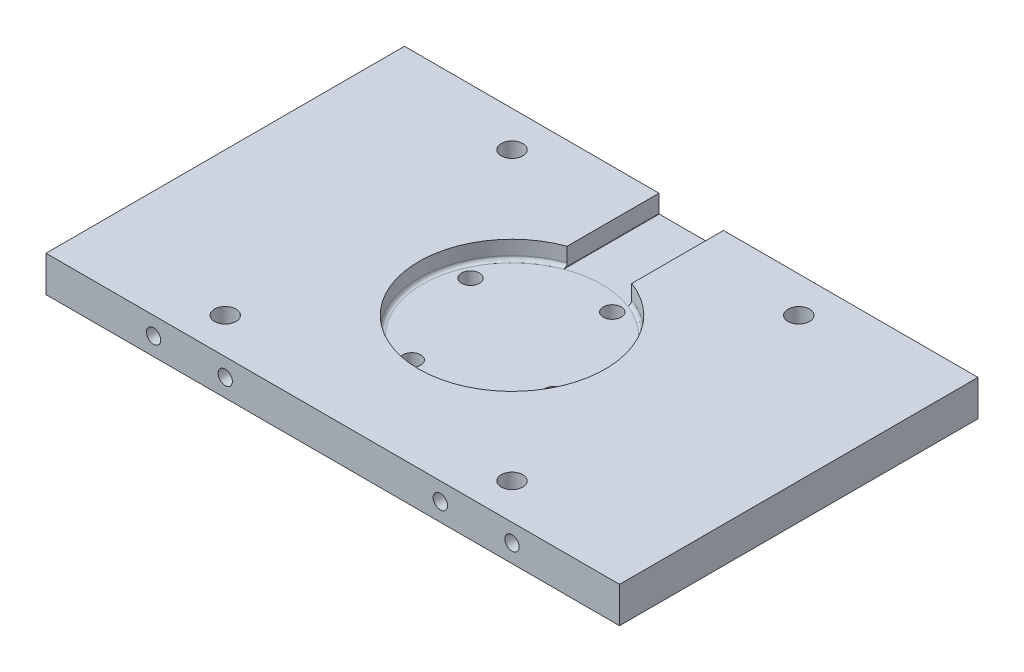
ISO-10303-21;
HEADER;
FILE_DESCRIPTION(('STEP AP214'),'2;1');
FILE_NAME('part.step','',(''),(''),'','','');
FILE_SCHEMA(('AUTOMOTIVE_DESIGN { 1 0 10303 214 1 1 1 1 }'));
ENDSEC;
DATA;
#1=APPLICATION_CONTEXT('core data for automotive mechanical design processes');
#2=APPLICATION_PROTOCOL_DEFINITION('international standard','automotive_design',2000,#1);
#3=PRODUCT_CONTEXT('',#1,'mechanical');
#4=PRODUCT('Part','Part','',(#3));
#5=PRODUCT_RELATED_PRODUCT_CATEGORY('part','',(#4));
#6=PRODUCT_DEFINITION_FORMATION('','',#4);
#7=PRODUCT_DEFINITION_CONTEXT('part definition',#1,'design');
#8=PRODUCT_DEFINITION('design','',#6,#7);
#9=PRODUCT_DEFINITION_SHAPE('','',#8);
#10=(LENGTH_UNIT() NAMED_UNIT(*) SI_UNIT(.MILLI.,.METRE.));
#11=(NAMED_UNIT(*) PLANE_ANGLE_UNIT() SI_UNIT($,.RADIAN.));
#12=(NAMED_UNIT(*) SI_UNIT($,.STERADIAN.) SOLID_ANGLE_UNIT());
#13=UNCERTAINTY_MEASURE_WITH_UNIT(LENGTH_MEASURE(1.E-05),#10,'distance_accuracy_value','');
#14=(GEOMETRIC_REPRESENTATION_CONTEXT(3) GLOBAL_UNCERTAINTY_ASSIGNED_CONTEXT((#13)) GLOBAL_UNIT_ASSIGNED_CONTEXT((#10,
#11,#12)) REPRESENTATION_CONTEXT('',''));
#15=CARTESIAN_POINT('',(0.,0.,0.));
#16=DIRECTION('',(0.,0.,1.));
#17=DIRECTION('',(1.,0.,0.));
#18=AXIS2_PLACEMENT_3D('',#15,#16,#17);
#19=CARTESIAN_POINT('',(80.,10.,-50.));
#20=DIRECTION('',(0.,0.,1.));
#21=DIRECTION('',(1.,0.,0.));
#22=AXIS2_PLACEMENT_3D('',#19,#20,#21);
#23=PLANE('',#22);
#24=CARTESIAN_POINT('',(-30.,5.00000000000001,-50.));
#25=DIRECTION('',(0.,0.,-1.));
#26=DIRECTION('',(-1.,0.,0.));
#27=AXIS2_PLACEMENT_3D('',#24,#25,#26);
#28=CIRCLE('',#27,2.);
#29=CARTESIAN_POINT('',(-31.9999999999999,5.00000000000001,-50.));
#30=VERTEX_POINT('',#29);
#31=EDGE_CURVE('E170',#30,#30,#28,.T.);
#32=ORIENTED_EDGE('',*,*,#31,.F.);
#33=EDGE_LOOP('',(#32));
#34=FACE_BOUND('',#33,.T.);
#35=CARTESIAN_POINT('',(30.,5.00000000000001,-50.));
#36=DIRECTION('',(0.,0.,-1.));
#37=DIRECTION('',(-1.,0.,0.));
#38=AXIS2_PLACEMENT_3D('',#35,#36,#37);
#39=CIRCLE('',#38,2.);
#40=CARTESIAN_POINT('',(28.,5.00000000000001,-50.));
#41=VERTEX_POINT('',#40);
#42=EDGE_CURVE('E185',#41,#41,#39,.T.);
#43=ORIENTED_EDGE('',*,*,#42,.F.);
#44=EDGE_LOOP('',(#43));
#45=FACE_BOUND('',#44,.T.);
#46=CARTESIAN_POINT('',(50.,5.00000000000002,-50.));
#47=DIRECTION('',(0.,0.,-1.));
#48=DIRECTION('',(-1.,0.,0.));
#49=AXIS2_PLACEMENT_3D('',#46,#47,#48);
#50=CIRCLE('',#49,2.);
#51=CARTESIAN_POINT('',(48.,5.00000000000002,-50.));
#52=VERTEX_POINT('',#51);
#53=EDGE_CURVE('E193',#52,#52,#50,.T.);
#54=ORIENTED_EDGE('',*,*,#53,.F.);
#55=EDGE_LOOP('',(#54));
#56=FACE_BOUND('',#55,.T.);
#57=DIRECTION('',(0.,-1.,0.));
#58=VECTOR('',#57,1.);
#59=CARTESIAN_POINT('',(-9.,10.,-50.));
#60=LINE('',#59,#58);
#61=CARTESIAN_POINT('',(-9.,10.,-50.));
#62=VERTEX_POINT('',#61);
#63=CARTESIAN_POINT('',(-9.,5.1,-50.));
#64=VERTEX_POINT('',#63);
#65=EDGE_CURVE('E300',#62,#64,#60,.T.);
#66=ORIENTED_EDGE('',*,*,#65,.T.);
#67=CARTESIAN_POINT('',(-8.9,5.1,-50.));
#68=DIRECTION('',(0.,0.,1.));
#69=DIRECTION('',(1.,0.,0.));
#70=AXIS2_PLACEMENT_3D('',#67,#68,#69);
#71=CIRCLE('',#70,0.1);
#72=CARTESIAN_POINT('',(-8.9,5.,-50.));
#73=VERTEX_POINT('',#72);
#74=EDGE_CURVE('E383',#64,#73,#71,.T.);
#75=ORIENTED_EDGE('',*,*,#74,.T.);
#76=DIRECTION('',(-1.,0.,0.));
#77=VECTOR('',#76,1.);
#78=CARTESIAN_POINT('',(9.,5.,-50.));
#79=LINE('',#78,#77);
#80=CARTESIAN_POINT('',(8.9,5.,-50.));
#81=VERTEX_POINT('',#80);
#82=EDGE_CURVE('E304',#81,#73,#79,.T.);
#83=ORIENTED_EDGE('',*,*,#82,.F.);
#84=CARTESIAN_POINT('',(8.9,5.1,-50.));
#85=DIRECTION('',(0.,0.,1.));
#86=DIRECTION('',(1.,0.,0.));
#87=AXIS2_PLACEMENT_3D('',#84,#85,#86);
#88=CIRCLE('',#87,0.1);
#89=CARTESIAN_POINT('',(9.,5.1,-50.));
#90=VERTEX_POINT('',#89);
#91=EDGE_CURVE('E380',#81,#90,#88,.T.);
#92=ORIENTED_EDGE('',*,*,#91,.T.);
#93=DIRECTION('',(0.,-1.,0.));
#94=VECTOR('',#93,1.);
#95=CARTESIAN_POINT('',(9.,10.,-50.));
#96=LINE('',#95,#94);
#97=CARTESIAN_POINT('',(9.,10.,-50.));
#98=VERTEX_POINT('',#97);
#99=EDGE_CURVE('E308',#98,#90,#96,.T.);
#100=ORIENTED_EDGE('',*,*,#99,.F.);
#101=DIRECTION('',(-1.,0.,0.));
#102=VECTOR('',#101,1.);
#103=CARTESIAN_POINT('',(80.,10.,-50.));
#104=LINE('',#103,#102);
#105=CARTESIAN_POINT('',(80.,10.,-50.));
#106=VERTEX_POINT('',#105);
#107=EDGE_CURVE('E338',#106,#98,#104,.T.);
#108=ORIENTED_EDGE('',*,*,#107,.F.);
#109=DIRECTION('',(0.,-1.,0.));
#110=VECTOR('',#109,1.);
#111=CARTESIAN_POINT('',(80.,10.,-50.));
#112=LINE('',#111,#110);
#113=CARTESIAN_POINT('',(80.,0.,-50.));
#114=VERTEX_POINT('',#113);
#115=EDGE_CURVE('E357',#106,#114,#112,.T.);
#116=ORIENTED_EDGE('',*,*,#115,.T.);
#117=DIRECTION('',(-1.,0.,0.));
#118=VECTOR('',#117,1.);
#119=CARTESIAN_POINT('',(80.,0.,-50.));
#120=LINE('',#119,#118);
#121=CARTESIAN_POINT('',(-80.,0.,-50.));
#122=VERTEX_POINT('',#121);
#123=EDGE_CURVE('E331',#114,#122,#120,.T.);
#124=ORIENTED_EDGE('',*,*,#123,.T.);
#125=DIRECTION('',(0.,-1.,0.));
#126=VECTOR('',#125,1.);
#127=CARTESIAN_POINT('',(-80.,10.,-50.));
#128=LINE('',#127,#126);
#129=CARTESIAN_POINT('',(-80.,10.,-50.));
#130=VERTEX_POINT('',#129);
#131=EDGE_CURVE('E342',#130,#122,#128,.T.);
#132=ORIENTED_EDGE('',*,*,#131,.F.);
#133=EDGE_CURVE('E337',#62,#130,#104,.T.);
#134=ORIENTED_EDGE('',*,*,#133,.F.);
#135=EDGE_LOOP('',(#66,#75,#83,#92,#100,#108,#116,#124,#132,#134));
#136=FACE_BOUND('',#135,.T.);
#137=CARTESIAN_POINT('',(-50.,5.00000000000001,-50.));
#138=DIRECTION('',(0.,0.,-1.));
#139=DIRECTION('',(-1.,0.,0.));
#140=AXIS2_PLACEMENT_3D('',#137,#138,#139);
#141=CIRCLE('',#140,2.);
#142=CARTESIAN_POINT('',(-52.,5.00000000000001,-50.));
#143=VERTEX_POINT('',#142);
#144=EDGE_CURVE('E171',#143,#143,#141,.T.);
#145=ORIENTED_EDGE('',*,*,#144,.F.);
#146=EDGE_LOOP('',(#145));
#147=FACE_BOUND('',#146,.T.);
#148=ADVANCED_FACE('F47',(#34,#45,#56,#136,#147),#23,.F.);
#149=CARTESIAN_POINT('',(0.,5.,0.));
#150=DIRECTION('',(0.,1.,0.));
#151=DIRECTION('',(0.,0.,1.));
#152=AXIS2_PLACEMENT_3D('',#149,#150,#151);
#153=PLANE('',#152);
#154=CARTESIAN_POINT('',(0.,5.,0.));
#155=DIRECTION('',(0.,1.,0.));
#156=DIRECTION('',(0.,0.,1.));
#157=AXIS2_PLACEMENT_3D('',#154,#155,#156);
#158=CIRCLE('',#157,25.);
#159=CARTESIAN_POINT('',(-8.9,5.,-23.3621488737659));
#160=VERTEX_POINT('',#159);
#161=CARTESIAN_POINT('',(8.9,5.,-23.3621488737659));
#162=VERTEX_POINT('',#161);
#163=EDGE_CURVE('E387',#160,#162,#158,.F.);
#164=ORIENTED_EDGE('',*,*,#163,.T.);
#165=DIRECTION('',(0.,0.,-1.));
#166=VECTOR('',#165,1.);
#167=CARTESIAN_POINT('',(8.9,5.,0.));
#168=LINE('',#167,#166);
#169=EDGE_CURVE('E372',#162,#81,#168,.T.);
#170=ORIENTED_EDGE('',*,*,#169,.T.);
#171=ORIENTED_EDGE('',*,*,#82,.T.);
#172=DIRECTION('',(0.,0.,-1.));
#173=VECTOR('',#172,1.);
#174=CARTESIAN_POINT('',(-8.9,5.,-24.3926218353009));
#175=LINE('',#174,#173);
#176=EDGE_CURVE('E369',#73,#160,#175,.F.);
#177=ORIENTED_EDGE('',*,*,#176,.T.);
#178=EDGE_LOOP('',(#164,#170,#171,#177));
#179=FACE_BOUND('',#178,.T.);
#180=ADVANCED_FACE('F427',(#179),#153,.T.);
#181=CARTESIAN_POINT('',(0.,10.,0.));
#182=DIRECTION('',(0.,-1.,0.));
#183=DIRECTION('',(0.,0.,-1.));
#184=AXIS2_PLACEMENT_3D('',#181,#182,#183);
#185=PLANE('',#184);
#186=CARTESIAN_POINT('',(40.,10.,40.));
#187=DIRECTION('',(0.,-1.,0.));
#188=DIRECTION('',(0.,0.,-1.));
#189=AXIS2_PLACEMENT_3D('',#186,#187,#188);
#190=CIRCLE('',#189,3.);
#191=CARTESIAN_POINT('',(40.,10.,37.));
#192=VERTEX_POINT('',#191);
#193=EDGE_CURVE('E246',#192,#192,#190,.F.);
#194=ORIENTED_EDGE('',*,*,#193,.F.);
#195=EDGE_LOOP('',(#194));
#196=FACE_BOUND('',#195,.T.);
#197=CARTESIAN_POINT('',(-40.,10.,-40.));
#198=DIRECTION('',(0.,-1.,0.));
#199=DIRECTION('',(0.,0.,-1.));
#200=AXIS2_PLACEMENT_3D('',#197,#198,#199);
#201=CIRCLE('',#200,3.);
#202=CARTESIAN_POINT('',(-40.,10.,-43.));
#203=VERTEX_POINT('',#202);
#204=EDGE_CURVE('E247',#203,#203,#201,.F.);
#205=ORIENTED_EDGE('',*,*,#204,.F.);
#206=EDGE_LOOP('',(#205));
#207=FACE_BOUND('',#206,.T.);
#208=CARTESIAN_POINT('',(40.,10.,-40.));
#209=DIRECTION('',(0.,-1.,0.));
#210=DIRECTION('',(0.,0.,-1.));
#211=AXIS2_PLACEMENT_3D('',#208,#209,#210);
#212=CIRCLE('',#211,3.);
#213=CARTESIAN_POINT('',(40.,10.,-43.));
#214=VERTEX_POINT('',#213);
#215=EDGE_CURVE('E237',#214,#214,#212,.F.);
#216=ORIENTED_EDGE('',*,*,#215,.F.);
#217=EDGE_LOOP('',(#216));
#218=FACE_BOUND('',#217,.T.);
#219=CARTESIAN_POINT('',(-40.,10.,40.));
#220=DIRECTION('',(0.,-1.,0.));
#221=DIRECTION('',(0.,0.,-1.));
#222=AXIS2_PLACEMENT_3D('',#219,#220,#221);
#223=CIRCLE('',#222,3.);
#224=CARTESIAN_POINT('',(-40.,10.,37.));
#225=VERTEX_POINT('',#224);
#226=EDGE_CURVE('E261',#225,#225,#223,.F.);
#227=ORIENTED_EDGE('',*,*,#226,.F.);
#228=EDGE_LOOP('',(#227));
#229=FACE_BOUND('',#228,.T.);
#230=DIRECTION('',(0.,0.,-1.));
#231=VECTOR('',#230,1.);
#232=CARTESIAN_POINT('',(-9.,10.,50.001));
#233=LINE('',#232,#231);
#234=CARTESIAN_POINT('',(-9.,10.,-24.3926218353009));
#235=VERTEX_POINT('',#234);
#236=EDGE_CURVE('E314',#235,#62,#233,.T.);
#237=ORIENTED_EDGE('',*,*,#236,.T.);
#238=ORIENTED_EDGE('',*,*,#133,.T.);
#239=DIRECTION('',(0.,0.,1.));
#240=VECTOR('',#239,1.);
#241=CARTESIAN_POINT('',(-80.,10.,-50.));
#242=LINE('',#241,#240);
#243=CARTESIAN_POINT('',(-80.,10.,50.));
#244=VERTEX_POINT('',#243);
#245=EDGE_CURVE('E326',#130,#244,#242,.T.);
#246=ORIENTED_EDGE('',*,*,#245,.T.);
#247=DIRECTION('',(1.,0.,0.));
#248=VECTOR('',#247,1.);
#249=CARTESIAN_POINT('',(80.,10.,50.));
#250=LINE('',#249,#248);
#251=CARTESIAN_POINT('',(80.,10.,50.));
#252=VERTEX_POINT('',#251);
#253=EDGE_CURVE('E330',#244,#252,#250,.T.);
#254=ORIENTED_EDGE('',*,*,#253,.T.);
#255=DIRECTION('',(0.,0.,-1.));
#256=VECTOR('',#255,1.);
#257=CARTESIAN_POINT('',(80.,10.,-50.));
#258=LINE('',#257,#256);
#259=EDGE_CURVE('E334',#252,#106,#258,.T.);
#260=ORIENTED_EDGE('',*,*,#259,.T.);
#261=ORIENTED_EDGE('',*,*,#107,.T.);
#262=DIRECTION('',(0.,0.,-1.));
#263=VECTOR('',#262,1.);
#264=CARTESIAN_POINT('',(9.,10.,50.001));
#265=LINE('',#264,#263);
#266=CARTESIAN_POINT('',(9.,10.,-24.3926218353009));
#267=VERTEX_POINT('',#266);
#268=EDGE_CURVE('E311',#267,#98,#265,.T.);
#269=ORIENTED_EDGE('',*,*,#268,.F.);
#270=CARTESIAN_POINT('',(0.,10.,0.));
#271=DIRECTION('',(0.,1.,0.));
#272=DIRECTION('',(0.,0.,1.));
#273=AXIS2_PLACEMENT_3D('',#270,#271,#272);
#274=CIRCLE('',#273,26.);
#275=EDGE_CURVE('E321',#235,#267,#274,.T.);
#276=ORIENTED_EDGE('',*,*,#275,.F.);
#277=EDGE_LOOP('',(#237,#238,#246,#254,#260,#261,#269,#276));
#278=FACE_BOUND('',#277,.T.);
#279=ADVANCED_FACE('F433',(#196,#207,#218,#229,#278),#185,.F.);
#280=CARTESIAN_POINT('',(0.,5.,0.));
#281=DIRECTION('',(0.,1.,0.));
#282=DIRECTION('',(0.,0.,1.));
#283=AXIS2_PLACEMENT_3D('',#280,#281,#282);
#284=CYLINDRICAL_SURFACE('',#283,26.);
#285=DIRECTION('',(0.,1.,0.));
#286=VECTOR('',#285,1.);
#287=CARTESIAN_POINT('',(9.,5.,-24.3926218353009));
#288=LINE('',#287,#286);
#289=CARTESIAN_POINT('',(9.,6.,-24.3926218353009));
#290=VERTEX_POINT('',#289);
#291=EDGE_CURVE('E318',#290,#267,#288,.T.);
#292=ORIENTED_EDGE('',*,*,#291,.F.);
#293=CARTESIAN_POINT('',(0.,6.,0.));
#294=DIRECTION('',(0.,1.,0.));
#295=DIRECTION('',(0.,0.,1.));
#296=AXIS2_PLACEMENT_3D('',#293,#294,#295);
#297=CIRCLE('',#296,26.);
#298=CARTESIAN_POINT('',(-9.,6.,-24.3926218353009));
#299=VERTEX_POINT('',#298);
#300=EDGE_CURVE('E391',#290,#299,#297,.F.);
#301=ORIENTED_EDGE('',*,*,#300,.T.);
#302=DIRECTION('',(0.,1.,0.));
#303=VECTOR('',#302,1.);
#304=CARTESIAN_POINT('',(-9.,5.,-24.3926218353009));
#305=LINE('',#304,#303);
#306=EDGE_CURVE('E297',#299,#235,#305,.T.);
#307=ORIENTED_EDGE('',*,*,#306,.T.);
#308=ORIENTED_EDGE('',*,*,#275,.T.);
#309=EDGE_LOOP('',(#292,#301,#307,#308));
#310=FACE_BOUND('',#309,.T.);
#311=ADVANCED_FACE('F452',(#310),#284,.F.);
#312=CARTESIAN_POINT('',(-80.,10.,-50.));
#313=DIRECTION('',(1.,0.,0.));
#314=DIRECTION('',(0.,0.,-1.));
#315=AXIS2_PLACEMENT_3D('',#312,#313,#314);
#316=PLANE('',#315);
#317=DIRECTION('',(0.,0.,1.));
#318=VECTOR('',#317,1.);
#319=CARTESIAN_POINT('',(-80.,0.,-50.));
#320=LINE('',#319,#318);
#321=CARTESIAN_POINT('',(-80.,0.,50.));
#322=VERTEX_POINT('',#321);
#323=EDGE_CURVE('E325',#122,#322,#320,.T.);
#324=ORIENTED_EDGE('',*,*,#323,.T.);
#325=DIRECTION('',(0.,-1.,0.));
#326=VECTOR('',#325,1.);
#327=CARTESIAN_POINT('',(-80.,10.,50.));
#328=LINE('',#327,#326);
#329=EDGE_CURVE('E365',#244,#322,#328,.T.);
#330=ORIENTED_EDGE('',*,*,#329,.F.);
#331=ORIENTED_EDGE('',*,*,#245,.F.);
#332=ORIENTED_EDGE('',*,*,#131,.T.);
#333=EDGE_LOOP('',(#324,#330,#331,#332));
#334=FACE_BOUND('',#333,.T.);
#335=ADVANCED_FACE('F415',(#334),#316,.F.);
#336=CARTESIAN_POINT('',(80.,10.,50.));
#337=DIRECTION('',(0.,0.,-1.));
#338=DIRECTION('',(-1.,0.,0.));
#339=AXIS2_PLACEMENT_3D('',#336,#337,#338);
#340=PLANE('',#339);
#341=CARTESIAN_POINT('',(-50.,5.00000000000001,50.));
#342=DIRECTION('',(0.,0.,1.));
#343=DIRECTION('',(1.,0.,0.));
#344=AXIS2_PLACEMENT_3D('',#341,#342,#343);
#345=CIRCLE('',#344,2.);
#346=CARTESIAN_POINT('',(-47.9999999999999,5.00000000000001,50.));
#347=VERTEX_POINT('',#346);
#348=EDGE_CURVE('E201',#347,#347,#345,.T.);
#349=ORIENTED_EDGE('',*,*,#348,.F.);
#350=EDGE_LOOP('',(#349));
#351=FACE_BOUND('',#350,.T.);
#352=CARTESIAN_POINT('',(-30.,5.00000000000001,50.));
#353=DIRECTION('',(0.,0.,1.));
#354=DIRECTION('',(1.,0.,0.));
#355=AXIS2_PLACEMENT_3D('',#352,#353,#354);
#356=CIRCLE('',#355,2.);
#357=CARTESIAN_POINT('',(-28.,5.00000000000001,50.));
#358=VERTEX_POINT('',#357);
#359=EDGE_CURVE('E209',#358,#358,#356,.T.);
#360=ORIENTED_EDGE('',*,*,#359,.F.);
#361=EDGE_LOOP('',(#360));
#362=FACE_BOUND('',#361,.T.);
#363=CARTESIAN_POINT('',(30.,5.00000000000001,50.));
#364=DIRECTION('',(0.,0.,1.));
#365=DIRECTION('',(1.,0.,0.));
#366=AXIS2_PLACEMENT_3D('',#363,#364,#365);
#367=CIRCLE('',#366,2.);
#368=CARTESIAN_POINT('',(32.,5.00000000000001,50.));
#369=VERTEX_POINT('',#368);
#370=EDGE_CURVE('E217',#369,#369,#367,.T.);
#371=ORIENTED_EDGE('',*,*,#370,.F.);
#372=EDGE_LOOP('',(#371));
#373=FACE_BOUND('',#372,.T.);
#374=CARTESIAN_POINT('',(50.,5.00000000000002,50.));
#375=DIRECTION('',(0.,0.,1.));
#376=DIRECTION('',(1.,0.,0.));
#377=AXIS2_PLACEMENT_3D('',#374,#375,#376);
#378=CIRCLE('',#377,2.);
#379=CARTESIAN_POINT('',(52.,5.00000000000002,50.));
#380=VERTEX_POINT('',#379);
#381=EDGE_CURVE('E225',#380,#380,#378,.T.);
#382=ORIENTED_EDGE('',*,*,#381,.F.);
#383=EDGE_LOOP('',(#382));
#384=FACE_BOUND('',#383,.T.);
#385=DIRECTION('',(1.,0.,0.));
#386=VECTOR('',#385,1.);
#387=CARTESIAN_POINT('',(80.,0.,50.));
#388=LINE('',#387,#386);
#389=CARTESIAN_POINT('',(80.,0.,50.));
#390=VERTEX_POINT('',#389);
#391=EDGE_CURVE('E346',#322,#390,#388,.T.);
#392=ORIENTED_EDGE('',*,*,#391,.T.);
#393=DIRECTION('',(0.,-1.,0.));
#394=VECTOR('',#393,1.);
#395=CARTESIAN_POINT('',(80.,10.,50.));
#396=LINE('',#395,#394);
#397=EDGE_CURVE('E361',#252,#390,#396,.T.);
#398=ORIENTED_EDGE('',*,*,#397,.F.);
#399=ORIENTED_EDGE('',*,*,#253,.F.);
#400=ORIENTED_EDGE('',*,*,#329,.T.);
#401=EDGE_LOOP('',(#392,#398,#399,#400));
#402=FACE_BOUND('',#401,.T.);
#403=ADVANCED_FACE('F445',(#351,#362,#373,#384,#402),#340,.F.);
#404=CARTESIAN_POINT('',(80.,10.,-50.));
#405=DIRECTION('',(-1.,0.,0.));
#406=DIRECTION('',(0.,0.,1.));
#407=AXIS2_PLACEMENT_3D('',#404,#405,#406);
#408=PLANE('',#407);
#409=DIRECTION('',(0.,0.,-1.));
#410=VECTOR('',#409,1.);
#411=CARTESIAN_POINT('',(80.,0.,-50.));
#412=LINE('',#411,#410);
#413=EDGE_CURVE('E349',#390,#114,#412,.T.);
#414=ORIENTED_EDGE('',*,*,#413,.T.);
#415=ORIENTED_EDGE('',*,*,#115,.F.);
#416=ORIENTED_EDGE('',*,*,#259,.F.);
#417=ORIENTED_EDGE('',*,*,#397,.T.);
#418=EDGE_LOOP('',(#414,#415,#416,#417));
#419=FACE_BOUND('',#418,.T.);
#420=ADVANCED_FACE('F443',(#419),#408,.F.);
#421=CARTESIAN_POINT('',(0.,0.,0.));
#422=DIRECTION('',(0.,-1.,0.));
#423=DIRECTION('',(0.,0.,-1.));
#424=AXIS2_PLACEMENT_3D('',#421,#422,#423);
#425=PLANE('',#424);
#426=CARTESIAN_POINT('',(40.,0.,40.));
#427=DIRECTION('',(0.,-1.,0.));
#428=DIRECTION('',(0.,0.,-1.));
#429=AXIS2_PLACEMENT_3D('',#426,#427,#428);
#430=CIRCLE('',#429,3.);
#431=CARTESIAN_POINT('',(40.,0.,37.));
#432=VERTEX_POINT('',#431);
#433=EDGE_CURVE('E242',#432,#432,#430,.T.);
#434=ORIENTED_EDGE('',*,*,#433,.F.);
#435=EDGE_LOOP('',(#434));
#436=FACE_BOUND('',#435,.T.);
#437=CARTESIAN_POINT('',(-40.,0.,-40.));
#438=DIRECTION('',(0.,-1.,0.));
#439=DIRECTION('',(0.,0.,-1.));
#440=AXIS2_PLACEMENT_3D('',#437,#438,#439);
#441=CIRCLE('',#440,3.);
#442=CARTESIAN_POINT('',(-40.,0.,-43.));
#443=VERTEX_POINT('',#442);
#444=EDGE_CURVE('E241',#443,#443,#441,.T.);
#445=ORIENTED_EDGE('',*,*,#444,.F.);
#446=EDGE_LOOP('',(#445));
#447=FACE_BOUND('',#446,.T.);
#448=CARTESIAN_POINT('',(40.,0.,-40.));
#449=DIRECTION('',(0.,-1.,0.));
#450=DIRECTION('',(0.,0.,-1.));
#451=AXIS2_PLACEMENT_3D('',#448,#449,#450);
#452=CIRCLE('',#451,3.);
#453=CARTESIAN_POINT('',(40.,0.,-43.));
#454=VERTEX_POINT('',#453);
#455=EDGE_CURVE('E233',#454,#454,#452,.T.);
#456=ORIENTED_EDGE('',*,*,#455,.F.);
#457=EDGE_LOOP('',(#456));
#458=FACE_BOUND('',#457,.T.);
#459=CARTESIAN_POINT('',(-40.,0.,40.));
#460=DIRECTION('',(0.,-1.,0.));
#461=DIRECTION('',(0.,0.,-1.));
#462=AXIS2_PLACEMENT_3D('',#459,#460,#461);
#463=CIRCLE('',#462,3.);
#464=CARTESIAN_POINT('',(-40.,0.,37.));
#465=VERTEX_POINT('',#464);
#466=EDGE_CURVE('E251',#465,#465,#463,.T.);
#467=ORIENTED_EDGE('',*,*,#466,.F.);
#468=EDGE_LOOP('',(#467));
#469=FACE_BOUND('',#468,.T.);
#470=CARTESIAN_POINT('',(-8.18942545261293,0.,19.7710219957415));
#471=DIRECTION('',(0.,-1.,0.));
#472=DIRECTION('',(0.,0.,-1.));
#473=AXIS2_PLACEMENT_3D('',#470,#471,#472);
#474=CIRCLE('',#473,2.5);
#475=CARTESIAN_POINT('',(-8.18942545261293,0.,17.2710219957415));
#476=VERTEX_POINT('',#475);
#477=EDGE_CURVE('E265',#476,#476,#474,.T.);
#478=ORIENTED_EDGE('',*,*,#477,.F.);
#479=EDGE_LOOP('',(#478));
#480=FACE_BOUND('',#479,.T.);
#481=CARTESIAN_POINT('',(19.7710219957415,0.,8.18942545261294));
#482=DIRECTION('',(0.,-1.,0.));
#483=DIRECTION('',(0.,0.,-1.));
#484=AXIS2_PLACEMENT_3D('',#481,#482,#483);
#485=CIRCLE('',#484,2.5);
#486=CARTESIAN_POINT('',(19.7710219957415,0.,5.68942545261294));
#487=VERTEX_POINT('',#486);
#488=EDGE_CURVE('E273',#487,#487,#485,.T.);
#489=ORIENTED_EDGE('',*,*,#488,.F.);
#490=EDGE_LOOP('',(#489));
#491=FACE_BOUND('',#490,.T.);
#492=CARTESIAN_POINT('',(8.18942545261293,0.,-19.7710219957415));
#493=DIRECTION('',(0.,-1.,0.));
#494=DIRECTION('',(0.,0.,-1.));
#495=AXIS2_PLACEMENT_3D('',#492,#493,#494);
#496=CIRCLE('',#495,2.5);
#497=CARTESIAN_POINT('',(8.18942545261293,0.,-22.2710219957415));
#498=VERTEX_POINT('',#497);
#499=EDGE_CURVE('E281',#498,#498,#496,.T.);
#500=ORIENTED_EDGE('',*,*,#499,.F.);
#501=EDGE_LOOP('',(#500));
#502=FACE_BOUND('',#501,.T.);
#503=CARTESIAN_POINT('',(-19.7710219957415,0.,-8.18942545261292));
#504=DIRECTION('',(0.,-1.,0.));
#505=DIRECTION('',(0.,0.,-1.));
#506=AXIS2_PLACEMENT_3D('',#503,#504,#505);
#507=CIRCLE('',#506,2.5);
#508=CARTESIAN_POINT('',(-19.7710219957415,0.,-10.6894254526129));
#509=VERTEX_POINT('',#508);
#510=EDGE_CURVE('E289',#509,#509,#507,.T.);
#511=ORIENTED_EDGE('',*,*,#510,.F.);
#512=EDGE_LOOP('',(#511));
#513=FACE_BOUND('',#512,.T.);
#514=ORIENTED_EDGE('',*,*,#323,.F.);
#515=ORIENTED_EDGE('',*,*,#123,.F.);
#516=ORIENTED_EDGE('',*,*,#413,.F.);
#517=ORIENTED_EDGE('',*,*,#391,.F.);
#518=EDGE_LOOP('',(#514,#515,#516,#517));
#519=FACE_BOUND('',#518,.T.);
#520=ADVANCED_FACE('F441',(#436,#447,#458,#469,#480,#491,#502,#513,#519),#425,.T.);
#521=ORIENTED_EDGE('',*,*,#163,.F.);
#522=EDGE_CURVE('E386',#162,#160,#158,.F.);
#523=ORIENTED_EDGE('',*,*,#522,.F.);
#524=EDGE_LOOP('',(#521,#523));
#525=FACE_BOUND('',#524,.T.);
#526=CARTESIAN_POINT('',(-8.18942545261293,5.,19.7710219957415));
#527=DIRECTION('',(0.,1.,0.));
#528=DIRECTION('',(0.,0.,1.));
#529=AXIS2_PLACEMENT_3D('',#526,#527,#528);
#530=CIRCLE('',#529,2.5);
#531=CARTESIAN_POINT('',(-8.18942545261293,5.,22.2710219957415));
#532=VERTEX_POINT('',#531);
#533=EDGE_CURVE('E269',#532,#532,#530,.T.);
#534=ORIENTED_EDGE('',*,*,#533,.F.);
#535=EDGE_LOOP('',(#534));
#536=FACE_BOUND('',#535,.T.);
#537=CARTESIAN_POINT('',(19.7710219957415,5.,8.18942545261294));
#538=DIRECTION('',(0.,1.,0.));
#539=DIRECTION('',(0.,0.,1.));
#540=AXIS2_PLACEMENT_3D('',#537,#538,#539);
#541=CIRCLE('',#540,2.5);
#542=CARTESIAN_POINT('',(19.7710219957415,5.,10.6894254526129));
#543=VERTEX_POINT('',#542);
#544=EDGE_CURVE('E277',#543,#543,#541,.T.);
#545=ORIENTED_EDGE('',*,*,#544,.F.);
#546=EDGE_LOOP('',(#545));
#547=FACE_BOUND('',#546,.T.);
#548=CARTESIAN_POINT('',(8.18942545261293,5.,-19.7710219957415));
#549=DIRECTION('',(0.,1.,0.));
#550=DIRECTION('',(0.,0.,1.));
#551=AXIS2_PLACEMENT_3D('',#548,#549,#550);
#552=CIRCLE('',#551,2.5);
#553=CARTESIAN_POINT('',(8.18942545261293,5.,-17.2710219957415));
#554=VERTEX_POINT('',#553);
#555=EDGE_CURVE('E285',#554,#554,#552,.T.);
#556=ORIENTED_EDGE('',*,*,#555,.F.);
#557=EDGE_LOOP('',(#556));
#558=FACE_BOUND('',#557,.T.);
#559=CARTESIAN_POINT('',(-19.7710219957415,5.,-8.18942545261292));
#560=DIRECTION('',(0.,1.,0.));
#561=DIRECTION('',(0.,0.,1.));
#562=AXIS2_PLACEMENT_3D('',#559,#560,#561);
#563=CIRCLE('',#562,2.5);
#564=CARTESIAN_POINT('',(-19.7710219957415,5.,-5.68942545261292));
#565=VERTEX_POINT('',#564);
#566=EDGE_CURVE('E293',#565,#565,#563,.T.);
#567=ORIENTED_EDGE('',*,*,#566,.F.);
#568=EDGE_LOOP('',(#567));
#569=FACE_BOUND('',#568,.T.);
#570=ADVANCED_FACE('F436',(#525,#536,#547,#558,#569),#153,.T.);
#571=CARTESIAN_POINT('',(-9.,10.,50.001));
#572=DIRECTION('',(1.,0.,0.));
#573=DIRECTION('',(0.,0.,-1.));
#574=AXIS2_PLACEMENT_3D('',#571,#572,#573);
#575=PLANE('',#574);
#576=ORIENTED_EDGE('',*,*,#306,.F.);
#577=CARTESIAN_POINT('',(-9.,6.,-24.3926218353009));
#578=CARTESIAN_POINT('',(-9.,5.97313540953937,-24.3926225109022));
#579=CARTESIAN_POINT('',(-9.,5.94628415533381,-24.3914671378204));
#580=CARTESIAN_POINT('',(-9.,5.89278337656902,-24.3868637865561));
#581=CARTESIAN_POINT('',(-9.,5.86613381886259,-24.3834161937359));
#582=CARTESIAN_POINT('',(-9.,5.78690908562282,-24.3696936019912));
#583=CARTESIAN_POINT('',(-9.,5.73488058844672,-24.3560384944866));
#584=CARTESIAN_POINT('',(-9.,5.63388651536836,-24.3202279540519));
#585=CARTESIAN_POINT('',(-9.,5.58492046790754,-24.2980738335734));
#586=CARTESIAN_POINT('',(-9.,5.49125784371963,-24.2460486317667));
#587=CARTESIAN_POINT('',(-9.,5.44656286297151,-24.2161746810785));
#588=CARTESIAN_POINT('',(-9.,5.36144578827852,-24.1488617121313));
#589=CARTESIAN_POINT('',(-9.,5.32116060312304,-24.1112502382244));
#590=CARTESIAN_POINT('',(-9.,5.24705822059419,-24.0301300754847));
#591=CARTESIAN_POINT('',(-9.,5.21323933135564,-23.9866229343203));
#592=CARTESIAN_POINT('',(-9.,5.16715895161276,-23.9168746264503));
#593=CARTESIAN_POINT('',(-9.,5.15231106408997,-23.8923005838549));
#594=CARTESIAN_POINT('',(-9.,5.12464081033554,-23.8421152375426));
#595=CARTESIAN_POINT('',(-9.,5.11181358396051,-23.8165066147619));
#596=CARTESIAN_POINT('',(-9.,5.1,-23.7904286366955));
#597=B_SPLINE_CURVE_WITH_KNOTS('',3,(#577,#578,#579,#580,#581,#582,#583,#584,#585,#586,#587,
#588,#589,#590,#591,#592,#593,#594,#595,#596),.UNSPECIFIED.,.F.,.F.,(4,2,2,2,2,2,2,2,2,4),(0.,
0.0805426873892279,0.161071837560916,0.321605328599573,0.482114039386988,0.642682495189611,
0.807318146765571,0.971910663348242,1.05796636322123,1.14381181091936),.UNSPECIFIED.);
#598=CARTESIAN_POINT('',(-9.,5.1,-23.7904286366955));
#599=VERTEX_POINT('',#598);
#600=EDGE_CURVE('E61',#299,#599,#597,.T.);
#601=ORIENTED_EDGE('',*,*,#600,.T.);
#602=DIRECTION('',(0.,0.,-1.));
#603=VECTOR('',#602,1.);
#604=CARTESIAN_POINT('',(-9.,5.1,-50.));
#605=LINE('',#604,#603);
#606=EDGE_CURVE('E67',#599,#64,#605,.T.);
#607=ORIENTED_EDGE('',*,*,#606,.T.);
#608=ORIENTED_EDGE('',*,*,#65,.F.);
#609=ORIENTED_EDGE('',*,*,#236,.F.);
#610=EDGE_LOOP('',(#576,#601,#607,#608,#609));
#611=FACE_BOUND('',#610,.T.);
#612=ADVANCED_FACE('F563',(#611),#575,.T.);
#613=CARTESIAN_POINT('',(9.,10.,50.001));
#614=DIRECTION('',(1.,0.,0.));
#615=DIRECTION('',(0.,0.,-1.));
#616=AXIS2_PLACEMENT_3D('',#613,#614,#615);
#617=PLANE('',#616);
#618=ORIENTED_EDGE('',*,*,#99,.T.);
#619=DIRECTION('',(0.,0.,-1.));
#620=VECTOR('',#619,1.);
#621=CARTESIAN_POINT('',(9.,5.1,50.001));
#622=LINE('',#621,#620);
#623=CARTESIAN_POINT('',(9.,5.1,-23.7904286366955));
#624=VERTEX_POINT('',#623);
#625=EDGE_CURVE('E75',#90,#624,#622,.F.);
#626=ORIENTED_EDGE('',*,*,#625,.T.);
#627=CARTESIAN_POINT('',(9.,5.1,-23.7904286366955));
#628=CARTESIAN_POINT('',(9.,5.12431444500345,-23.8442122195132));
#629=CARTESIAN_POINT('',(9.,5.15305374511394,-23.8960397037974));
#630=CARTESIAN_POINT('',(9.,5.21871746612439,-23.9943536352026));
#631=CARTESIAN_POINT('',(9.,5.25565717149334,-24.040829859353));
#632=CARTESIAN_POINT('',(9.,5.33703890794557,-24.1268819152072));
#633=CARTESIAN_POINT('',(9.,5.38149531475952,-24.1664442234809));
#634=CARTESIAN_POINT('',(9.,5.47669167431082,-24.2370606019413));
#635=CARTESIAN_POINT('',(9.,5.52742665994469,-24.2681213361872));
#636=CARTESIAN_POINT('',(9.,5.63117075875993,-24.3192442596914));
#637=CARTESIAN_POINT('',(9.,5.68395745870051,-24.3397587098429));
#638=CARTESIAN_POINT('',(9.,5.79229859249391,-24.3710842049366));
#639=CARTESIAN_POINT('',(9.,5.84784813939655,-24.3819117819693));
#640=CARTESIAN_POINT('',(9.,5.91981977449301,-24.3893291697678));
#641=CARTESIAN_POINT('',(9.,5.93584526096906,-24.3905644422549));
#642=CARTESIAN_POINT('',(9.,5.96791152220399,-24.3922095073883));
#643=CARTESIAN_POINT('',(9.,5.98395222580517,-24.3926206862394));
#644=CARTESIAN_POINT('',(9.,6.,-24.3926218353009));
#645=B_SPLINE_CURVE_WITH_KNOTS('',3,(#627,#628,#629,#630,#631,#632,#633,#634,#635,#636,#637,
#638,#639,#640,#641,#642,#643,#644),.UNSPECIFIED.,.F.,.F.,(4,2,2,2,2,2,2,2,4),(0.,
0.176946040304126,0.354224695745632,0.531846314106096,0.709328300309189,0.878381859526595,
1.04714635025346,1.09535143326748,1.14347536241446),.UNSPECIFIED.);
#646=EDGE_CURVE('E402',#624,#290,#645,.T.);
#647=ORIENTED_EDGE('',*,*,#646,.T.);
#648=ORIENTED_EDGE('',*,*,#291,.T.);
#649=ORIENTED_EDGE('',*,*,#268,.T.);
#650=EDGE_LOOP('',(#618,#626,#647,#648,#649));
#651=FACE_BOUND('',#650,.T.);
#652=ADVANCED_FACE('F413',(#651),#617,.F.);
#653=CARTESIAN_POINT('',(8.9,5.1,0.));
#654=DIRECTION('',(0.,0.,-1.));
#655=DIRECTION('',(-1.,0.,0.));
#656=AXIS2_PLACEMENT_3D('',#653,#654,#655);
#657=CYLINDRICAL_SURFACE('',#656,0.1);
#658=ORIENTED_EDGE('',*,*,#169,.F.);
#659=CARTESIAN_POINT('',(9.,5.1,-23.7904286366955));
#660=CARTESIAN_POINT('',(8.99999060939297,5.09298859825492,-23.7749625197573));
#661=CARTESIAN_POINT('',(8.99926504965397,5.08624811363365,-23.7593954238809));
#662=CARTESIAN_POINT('',(8.99662393149902,5.07340952498364,-23.7281226866107));
#663=CARTESIAN_POINT('',(8.99471013240321,5.06731048680627,-23.7124172838255));
#664=CARTESIAN_POINT('',(8.98756164818469,5.05013571261904,-23.6652289002905));
#665=CARTESIAN_POINT('',(8.98091645169705,5.04013249393881,-23.6335660053267));
#666=CARTESIAN_POINT('',(8.96355355724286,5.02153944930744,-23.5631254398198));
#667=CARTESIAN_POINT('',(8.95226572872951,5.01372406045227,-23.5242910312955));
#668=CARTESIAN_POINT('',(8.92803576528295,5.0031047893319,-23.4464703643188));
#669=CARTESIAN_POINT('',(8.91509436047216,5.00029870338976,-23.4074841802034));
#670=CARTESIAN_POINT('',(8.90141715976982,5.00000751045815,-23.3664046483443));
#671=CARTESIAN_POINT('',(8.90070855521063,4.99999997722737,-23.3642766995494));
#672=CARTESIAN_POINT('',(8.9,5.,-23.3621488737659));
#673=B_SPLINE_CURVE_WITH_KNOTS('',3,(#659,#660,#661,#662,#663,#664,#665,#666,#667,#668,#669,
#670,#671,#672),.UNSPECIFIED.,.F.,.F.,(4,2,2,2,2,2,4),(0.,0.0508962252767922,0.101717272164256,
0.203006665025867,0.326217526663433,0.449374172392597,0.456102640650455),.UNSPECIFIED.);
#674=EDGE_CURVE('E394',#162,#624,#673,.F.);
#675=ORIENTED_EDGE('',*,*,#674,.T.);
#676=ORIENTED_EDGE('',*,*,#625,.F.);
#677=ORIENTED_EDGE('',*,*,#91,.F.);
#678=EDGE_LOOP('',(#658,#675,#676,#677));
#679=FACE_BOUND('',#678,.T.);
#680=ADVANCED_FACE('F408',(#679),#657,.F.);
#681=CARTESIAN_POINT('',(-8.9,5.1,50.001));
#682=DIRECTION('',(0.,0.,1.));
#683=DIRECTION('',(1.,0.,0.));
#684=AXIS2_PLACEMENT_3D('',#681,#682,#683);
#685=CYLINDRICAL_SURFACE('',#684,0.1);
#686=ORIENTED_EDGE('',*,*,#606,.F.);
#687=CARTESIAN_POINT('',(-9.,5.1,-23.7904286366955));
#688=CARTESIAN_POINT('',(-8.99999060939298,5.09298859825492,-23.7749625197573));
#689=CARTESIAN_POINT('',(-8.99926504965398,5.08624811363365,-23.7593954238809));
#690=CARTESIAN_POINT('',(-8.99662393149903,5.07340952498364,-23.7281226866107));
#691=CARTESIAN_POINT('',(-8.99471013240321,5.06731048680627,-23.7124172838255));
#692=CARTESIAN_POINT('',(-8.98756164818469,5.05013571261904,-23.6652289002905));
#693=CARTESIAN_POINT('',(-8.98091645169706,5.04013249393881,-23.6335660053267));
#694=CARTESIAN_POINT('',(-8.96355355724287,5.02153944930744,-23.5631254398198));
#695=CARTESIAN_POINT('',(-8.95226572872951,5.01372406045227,-23.5242910312955));
#696=CARTESIAN_POINT('',(-8.92803576528295,5.0031047893319,-23.4464703643188));
#697=CARTESIAN_POINT('',(-8.91509436047217,5.00029870338976,-23.4074841802034));
#698=CARTESIAN_POINT('',(-8.90141715976982,5.00000751045815,-23.3664046483443));
#699=CARTESIAN_POINT('',(-8.90070855521063,4.99999997722737,-23.3642766995494));
#700=CARTESIAN_POINT('',(-8.9,5.,-23.3621488737659));
#701=B_SPLINE_CURVE_WITH_KNOTS('',3,(#687,#688,#689,#690,#691,#692,#693,#694,#695,#696,#697,
#698,#699,#700),.UNSPECIFIED.,.F.,.F.,(4,2,2,2,2,2,4),(0.,0.0508962252767911,0.101717272164256,
0.203006665025866,0.326217526663429,0.449374172392596,0.456102640650455),.UNSPECIFIED.);
#702=EDGE_CURVE('E11',#599,#160,#701,.T.);
#703=ORIENTED_EDGE('',*,*,#702,.T.);
#704=ORIENTED_EDGE('',*,*,#176,.F.);
#705=ORIENTED_EDGE('',*,*,#74,.F.);
#706=EDGE_LOOP('',(#686,#703,#704,#705));
#707=FACE_BOUND('',#706,.T.);
#708=ADVANCED_FACE('F412',(#707),#685,.F.);
#709=CARTESIAN_POINT('',(-19.7710219957415,0.,-8.18942545261292));
#710=DIRECTION('',(0.,-1.,0.));
#711=DIRECTION('',(0.,0.,-1.));
#712=AXIS2_PLACEMENT_3D('',#709,#710,#711);
#713=CYLINDRICAL_SURFACE('',#712,2.5);
#714=ORIENTED_EDGE('',*,*,#510,.T.);
#715=EDGE_LOOP('',(#714));
#716=FACE_BOUND('',#715,.T.);
#717=ORIENTED_EDGE('',*,*,#566,.T.);
#718=EDGE_LOOP('',(#717));
#719=FACE_BOUND('',#718,.T.);
#720=ADVANCED_FACE('F419',(#716,#719),#713,.F.);
#721=CARTESIAN_POINT('',(8.18942545261293,0.,-19.7710219957415));
#722=DIRECTION('',(0.,-1.,0.));
#723=DIRECTION('',(0.,0.,-1.));
#724=AXIS2_PLACEMENT_3D('',#721,#722,#723);
#725=CYLINDRICAL_SURFACE('',#724,2.5);
#726=ORIENTED_EDGE('',*,*,#499,.T.);
#727=EDGE_LOOP('',(#726));
#728=FACE_BOUND('',#727,.T.);
#729=ORIENTED_EDGE('',*,*,#555,.T.);
#730=EDGE_LOOP('',(#729));
#731=FACE_BOUND('',#730,.T.);
#732=ADVANCED_FACE('F423',(#728,#731),#725,.F.);
#733=CARTESIAN_POINT('',(19.7710219957415,0.,8.18942545261294));
#734=DIRECTION('',(0.,-1.,0.));
#735=DIRECTION('',(0.,0.,-1.));
#736=AXIS2_PLACEMENT_3D('',#733,#734,#735);
#737=CYLINDRICAL_SURFACE('',#736,2.5);
#738=ORIENTED_EDGE('',*,*,#488,.T.);
#739=EDGE_LOOP('',(#738));
#740=FACE_BOUND('',#739,.T.);
#741=ORIENTED_EDGE('',*,*,#544,.T.);
#742=EDGE_LOOP('',(#741));
#743=FACE_BOUND('',#742,.T.);
#744=ADVANCED_FACE('F603',(#740,#743),#737,.F.);
#745=CARTESIAN_POINT('',(-8.18942545261293,0.,19.7710219957415));
#746=DIRECTION('',(0.,-1.,0.));
#747=DIRECTION('',(0.,0.,-1.));
#748=AXIS2_PLACEMENT_3D('',#745,#746,#747);
#749=CYLINDRICAL_SURFACE('',#748,2.5);
#750=ORIENTED_EDGE('',*,*,#477,.T.);
#751=EDGE_LOOP('',(#750));
#752=FACE_BOUND('',#751,.T.);
#753=ORIENTED_EDGE('',*,*,#533,.T.);
#754=EDGE_LOOP('',(#753));
#755=FACE_BOUND('',#754,.T.);
#756=ADVANCED_FACE('F596',(#752,#755),#749,.F.);
#757=CARTESIAN_POINT('',(0.,6.,0.));
#758=DIRECTION('',(0.,1.,0.));
#759=DIRECTION('',(0.,0.,1.));
#760=AXIS2_PLACEMENT_3D('',#757,#758,#759);
#761=TOROIDAL_SURFACE('',#760,25.,1.);
#762=ORIENTED_EDGE('',*,*,#600,.F.);
#763=ORIENTED_EDGE('',*,*,#300,.F.);
#764=ORIENTED_EDGE('',*,*,#646,.F.);
#765=ORIENTED_EDGE('',*,*,#674,.F.);
#766=ORIENTED_EDGE('',*,*,#522,.T.);
#767=ORIENTED_EDGE('',*,*,#702,.F.);
#768=EDGE_LOOP('',(#762,#763,#764,#765,#766,#767));
#769=FACE_BOUND('',#768,.T.);
#770=ADVANCED_FACE('F49',(#769),#761,.F.);
#771=CARTESIAN_POINT('',(-40.,10.001,40.));
#772=DIRECTION('',(0.,-1.,0.));
#773=DIRECTION('',(0.,0.,-1.));
#774=AXIS2_PLACEMENT_3D('',#771,#772,#773);
#775=CYLINDRICAL_SURFACE('',#774,3.);
#776=ORIENTED_EDGE('',*,*,#466,.T.);
#777=EDGE_LOOP('',(#776));
#778=FACE_BOUND('',#777,.T.);
#779=ORIENTED_EDGE('',*,*,#226,.T.);
#780=EDGE_LOOP('',(#779));
#781=FACE_BOUND('',#780,.T.);
#782=ADVANCED_FACE('F584',(#778,#781),#775,.F.);
#783=CARTESIAN_POINT('',(40.,10.001,-40.));
#784=DIRECTION('',(0.,-1.,0.));
#785=DIRECTION('',(0.,0.,-1.));
#786=AXIS2_PLACEMENT_3D('',#783,#784,#785);
#787=CYLINDRICAL_SURFACE('',#786,3.);
#788=ORIENTED_EDGE('',*,*,#455,.T.);
#789=EDGE_LOOP('',(#788));
#790=FACE_BOUND('',#789,.T.);
#791=ORIENTED_EDGE('',*,*,#215,.T.);
#792=EDGE_LOOP('',(#791));
#793=FACE_BOUND('',#792,.T.);
#794=ADVANCED_FACE('F586',(#790,#793),#787,.F.);
#795=CARTESIAN_POINT('',(-40.,10.001,-40.));
#796=DIRECTION('',(0.,-1.,0.));
#797=DIRECTION('',(0.,0.,-1.));
#798=AXIS2_PLACEMENT_3D('',#795,#796,#797);
#799=CYLINDRICAL_SURFACE('',#798,3.);
#800=ORIENTED_EDGE('',*,*,#444,.T.);
#801=EDGE_LOOP('',(#800));
#802=FACE_BOUND('',#801,.T.);
#803=ORIENTED_EDGE('',*,*,#204,.T.);
#804=EDGE_LOOP('',(#803));
#805=FACE_BOUND('',#804,.T.);
#806=ADVANCED_FACE('F593',(#802,#805),#799,.F.);
#807=CARTESIAN_POINT('',(40.,10.001,40.));
#808=DIRECTION('',(0.,-1.,0.));
#809=DIRECTION('',(0.,0.,-1.));
#810=AXIS2_PLACEMENT_3D('',#807,#808,#809);
#811=CYLINDRICAL_SURFACE('',#810,3.);
#812=ORIENTED_EDGE('',*,*,#433,.T.);
#813=EDGE_LOOP('',(#812));
#814=FACE_BOUND('',#813,.T.);
#815=ORIENTED_EDGE('',*,*,#193,.T.);
#816=EDGE_LOOP('',(#815));
#817=FACE_BOUND('',#816,.T.);
#818=ADVANCED_FACE('F647',(#814,#817),#811,.F.);
#819=CARTESIAN_POINT('',(50.,5.00000000000002,40.));
#820=DIRECTION('',(0.,0.,1.));
#821=DIRECTION('',(1.,0.,0.));
#822=AXIS2_PLACEMENT_3D('',#819,#820,#821);
#823=CONICAL_SURFACE('',#822,1.99999999999999,1.02974425867665);
#824=CARTESIAN_POINT('',(50.,5.00000000000002,38.7982787619449));
#825=VERTEX_POINT('',#824);
#826=VERTEX_LOOP('',#825);
#827=FACE_BOUND('',#826,.T.);
#828=CARTESIAN_POINT('',(50.,5.00000000000002,40.));
#829=DIRECTION('',(0.,0.,1.));
#830=DIRECTION('',(1.,0.,0.));
#831=AXIS2_PLACEMENT_3D('',#828,#829,#830);
#832=CIRCLE('',#831,1.99999999999999);
#833=CARTESIAN_POINT('',(52.,5.00000000000002,40.));
#834=VERTEX_POINT('',#833);
#835=EDGE_CURVE('E229',#834,#834,#832,.T.);
#836=ORIENTED_EDGE('',*,*,#835,.T.);
#837=EDGE_LOOP('',(#836));
#838=FACE_BOUND('',#837,.T.);
#839=ADVANCED_FACE('F651',(#827,#838),#823,.F.);
#840=CARTESIAN_POINT('',(50.,5.00000000000002,50.));
#841=DIRECTION('',(0.,0.,1.));
#842=DIRECTION('',(1.,0.,0.));
#843=AXIS2_PLACEMENT_3D('',#840,#841,#842);
#844=CYLINDRICAL_SURFACE('',#843,2.);
#845=ORIENTED_EDGE('',*,*,#835,.F.);
#846=EDGE_LOOP('',(#845));
#847=FACE_BOUND('',#846,.T.);
#848=ORIENTED_EDGE('',*,*,#381,.T.);
#849=EDGE_LOOP('',(#848));
#850=FACE_BOUND('',#849,.T.);
#851=ADVANCED_FACE('F656',(#847,#850),#844,.F.);
#852=CARTESIAN_POINT('',(30.,5.00000000000001,40.));
#853=DIRECTION('',(0.,0.,1.));
#854=DIRECTION('',(1.,0.,0.));
#855=AXIS2_PLACEMENT_3D('',#852,#853,#854);
#856=CONICAL_SURFACE('',#855,1.99999999999999,1.02974425867665);
#857=CARTESIAN_POINT('',(30.,5.00000000000001,38.7982787619449));
#858=VERTEX_POINT('',#857);
#859=VERTEX_LOOP('',#858);
#860=FACE_BOUND('',#859,.T.);
#861=CARTESIAN_POINT('',(30.,5.00000000000001,40.));
#862=DIRECTION('',(0.,0.,1.));
#863=DIRECTION('',(1.,0.,0.));
#864=AXIS2_PLACEMENT_3D('',#861,#862,#863);
#865=CIRCLE('',#864,1.99999999999999);
#866=CARTESIAN_POINT('',(32.,5.00000000000001,40.));
#867=VERTEX_POINT('',#866);
#868=EDGE_CURVE('E221',#867,#867,#865,.T.);
#869=ORIENTED_EDGE('',*,*,#868,.T.);
#870=EDGE_LOOP('',(#869));
#871=FACE_BOUND('',#870,.T.);
#872=ADVANCED_FACE('F663',(#860,#871),#856,.F.);
#873=CARTESIAN_POINT('',(30.,5.00000000000001,50.));
#874=DIRECTION('',(0.,0.,1.));
#875=DIRECTION('',(1.,0.,0.));
#876=AXIS2_PLACEMENT_3D('',#873,#874,#875);
#877=CYLINDRICAL_SURFACE('',#876,2.);
#878=ORIENTED_EDGE('',*,*,#868,.F.);
#879=EDGE_LOOP('',(#878));
#880=FACE_BOUND('',#879,.T.);
#881=ORIENTED_EDGE('',*,*,#370,.T.);
#882=EDGE_LOOP('',(#881));
#883=FACE_BOUND('',#882,.T.);
#884=ADVANCED_FACE('F667',(#880,#883),#877,.F.);
#885=CARTESIAN_POINT('',(-30.,5.00000000000001,40.));
#886=DIRECTION('',(0.,0.,1.));
#887=DIRECTION('',(1.,0.,0.));
#888=AXIS2_PLACEMENT_3D('',#885,#886,#887);
#889=CONICAL_SURFACE('',#888,2.,1.02974425867665);
#890=CARTESIAN_POINT('',(-30.,5.00000000000001,38.7982787619449));
#891=VERTEX_POINT('',#890);
#892=VERTEX_LOOP('',#891);
#893=FACE_BOUND('',#892,.T.);
#894=CARTESIAN_POINT('',(-30.,5.00000000000001,40.));
#895=DIRECTION('',(0.,0.,1.));
#896=DIRECTION('',(1.,0.,0.));
#897=AXIS2_PLACEMENT_3D('',#894,#895,#896);
#898=CIRCLE('',#897,2.);
#899=CARTESIAN_POINT('',(-28.,5.00000000000001,40.));
#900=VERTEX_POINT('',#899);
#901=EDGE_CURVE('E213',#900,#900,#898,.T.);
#902=ORIENTED_EDGE('',*,*,#901,.T.);
#903=EDGE_LOOP('',(#902));
#904=FACE_BOUND('',#903,.T.);
#905=ADVANCED_FACE('F671',(#893,#904),#889,.F.);
#906=CARTESIAN_POINT('',(-30.,5.00000000000001,50.));
#907=DIRECTION('',(0.,0.,1.));
#908=DIRECTION('',(1.,0.,0.));
#909=AXIS2_PLACEMENT_3D('',#906,#907,#908);
#910=CYLINDRICAL_SURFACE('',#909,2.);
#911=ORIENTED_EDGE('',*,*,#901,.F.);
#912=EDGE_LOOP('',(#911));
#913=FACE_BOUND('',#912,.T.);
#914=ORIENTED_EDGE('',*,*,#359,.T.);
#915=EDGE_LOOP('',(#914));
#916=FACE_BOUND('',#915,.T.);
#917=ADVANCED_FACE('F675',(#913,#916),#910,.F.);
#918=CARTESIAN_POINT('',(-50.,5.00000000000001,40.));
#919=DIRECTION('',(0.,0.,1.));
#920=DIRECTION('',(1.,0.,0.));
#921=AXIS2_PLACEMENT_3D('',#918,#919,#920);
#922=CONICAL_SURFACE('',#921,1.99999999999999,1.02974425867665);
#923=CARTESIAN_POINT('',(-50.,5.00000000000001,38.7982787619449));
#924=VERTEX_POINT('',#923);
#925=VERTEX_LOOP('',#924);
#926=FACE_BOUND('',#925,.T.);
#927=CARTESIAN_POINT('',(-50.,5.00000000000001,40.));
#928=DIRECTION('',(0.,0.,1.));
#929=DIRECTION('',(1.,0.,0.));
#930=AXIS2_PLACEMENT_3D('',#927,#928,#929);
#931=CIRCLE('',#930,1.99999999999999);
#932=CARTESIAN_POINT('',(-48.,5.00000000000001,40.));
#933=VERTEX_POINT('',#932);
#934=EDGE_CURVE('E205',#933,#933,#931,.T.);
#935=ORIENTED_EDGE('',*,*,#934,.T.);
#936=EDGE_LOOP('',(#935));
#937=FACE_BOUND('',#936,.T.);
#938=ADVANCED_FACE('F679',(#926,#937),#922,.F.);
#939=CARTESIAN_POINT('',(-50.,5.00000000000001,50.));
#940=DIRECTION('',(0.,0.,1.));
#941=DIRECTION('',(1.,0.,0.));
#942=AXIS2_PLACEMENT_3D('',#939,#940,#941);
#943=CYLINDRICAL_SURFACE('',#942,2.);
#944=ORIENTED_EDGE('',*,*,#934,.F.);
#945=EDGE_LOOP('',(#944));
#946=FACE_BOUND('',#945,.T.);
#947=ORIENTED_EDGE('',*,*,#348,.T.);
#948=EDGE_LOOP('',(#947));
#949=FACE_BOUND('',#948,.T.);
#950=ADVANCED_FACE('F683',(#946,#949),#943,.F.);
#951=CARTESIAN_POINT('',(50.,5.00000000000002,-40.));
#952=DIRECTION('',(0.,0.,-1.));
#953=DIRECTION('',(-1.,0.,0.));
#954=AXIS2_PLACEMENT_3D('',#951,#952,#953);
#955=CONICAL_SURFACE('',#954,1.99999999999999,1.02974425867665);
#956=CARTESIAN_POINT('',(50.,5.00000000000002,-38.7982787619449));
#957=VERTEX_POINT('',#956);
#958=VERTEX_LOOP('',#957);
#959=FACE_BOUND('',#958,.T.);
#960=CARTESIAN_POINT('',(50.,5.00000000000002,-40.));
#961=DIRECTION('',(0.,0.,-1.));
#962=DIRECTION('',(-1.,0.,0.));
#963=AXIS2_PLACEMENT_3D('',#960,#961,#962);
#964=CIRCLE('',#963,1.99999999999999);
#965=CARTESIAN_POINT('',(48.,5.00000000000002,-40.));
#966=VERTEX_POINT('',#965);
#967=EDGE_CURVE('E197',#966,#966,#964,.T.);
#968=ORIENTED_EDGE('',*,*,#967,.T.);
#969=EDGE_LOOP('',(#968));
#970=FACE_BOUND('',#969,.T.);
#971=ADVANCED_FACE('F687',(#959,#970),#955,.F.);
#972=CARTESIAN_POINT('',(50.,5.00000000000002,-50.));
#973=DIRECTION('',(0.,0.,-1.));
#974=DIRECTION('',(-1.,0.,0.));
#975=AXIS2_PLACEMENT_3D('',#972,#973,#974);
#976=CYLINDRICAL_SURFACE('',#975,2.);
#977=ORIENTED_EDGE('',*,*,#967,.F.);
#978=EDGE_LOOP('',(#977));
#979=FACE_BOUND('',#978,.T.);
#980=ORIENTED_EDGE('',*,*,#53,.T.);
#981=EDGE_LOOP('',(#980));
#982=FACE_BOUND('',#981,.T.);
#983=ADVANCED_FACE('F691',(#979,#982),#976,.F.);
#984=CARTESIAN_POINT('',(30.,5.00000000000001,-40.));
#985=DIRECTION('',(0.,0.,-1.));
#986=DIRECTION('',(-1.,0.,0.));
#987=AXIS2_PLACEMENT_3D('',#984,#985,#986);
#988=CONICAL_SURFACE('',#987,1.99999999999999,1.02974425867665);
#989=CARTESIAN_POINT('',(30.,5.00000000000001,-38.7982787619449));
#990=VERTEX_POINT('',#989);
#991=VERTEX_LOOP('',#990);
#992=FACE_BOUND('',#991,.T.);
#993=CARTESIAN_POINT('',(30.,5.00000000000001,-40.));
#994=DIRECTION('',(0.,0.,-1.));
#995=DIRECTION('',(-1.,0.,0.));
#996=AXIS2_PLACEMENT_3D('',#993,#994,#995);
#997=CIRCLE('',#996,1.99999999999999);
#998=CARTESIAN_POINT('',(28.,5.00000000000001,-40.));
#999=VERTEX_POINT('',#998);
#1000=EDGE_CURVE('E189',#999,#999,#997,.T.);
#1001=ORIENTED_EDGE('',*,*,#1000,.T.);
#1002=EDGE_LOOP('',(#1001));
#1003=FACE_BOUND('',#1002,.T.);
#1004=ADVANCED_FACE('F695',(#992,#1003),#988,.F.);
#1005=CARTESIAN_POINT('',(30.,5.00000000000001,-50.));
#1006=DIRECTION('',(0.,0.,-1.));
#1007=DIRECTION('',(-1.,0.,0.));
#1008=AXIS2_PLACEMENT_3D('',#1005,#1006,#1007);
#1009=CYLINDRICAL_SURFACE('',#1008,2.);
#1010=ORIENTED_EDGE('',*,*,#1000,.F.);
#1011=EDGE_LOOP('',(#1010));
#1012=FACE_BOUND('',#1011,.T.);
#1013=ORIENTED_EDGE('',*,*,#42,.T.);
#1014=EDGE_LOOP('',(#1013));
#1015=FACE_BOUND('',#1014,.T.);
#1016=ADVANCED_FACE('F699',(#1012,#1015),#1009,.F.);
#1017=CARTESIAN_POINT('',(-30.,5.00000000000001,-40.));
#1018=DIRECTION('',(0.,0.,-1.));
#1019=DIRECTION('',(-1.,0.,0.));
#1020=AXIS2_PLACEMENT_3D('',#1017,#1018,#1019);
#1021=CONICAL_SURFACE('',#1020,2.,1.02974425867665);
#1022=CARTESIAN_POINT('',(-30.,5.00000000000001,-38.7982787619449));
#1023=VERTEX_POINT('',#1022);
#1024=VERTEX_LOOP('',#1023);
#1025=FACE_BOUND('',#1024,.T.);
#1026=CARTESIAN_POINT('',(-30.,5.00000000000001,-40.));
#1027=DIRECTION('',(0.,0.,-1.));
#1028=DIRECTION('',(-1.,0.,0.));
#1029=AXIS2_PLACEMENT_3D('',#1026,#1027,#1028);
#1030=CIRCLE('',#1029,2.);
#1031=CARTESIAN_POINT('',(-31.9999999999999,5.00000000000001,-40.));
#1032=VERTEX_POINT('',#1031);
#1033=EDGE_CURVE('E177',#1032,#1032,#1030,.T.);
#1034=ORIENTED_EDGE('',*,*,#1033,.T.);
#1035=EDGE_LOOP('',(#1034));
#1036=FACE_BOUND('',#1035,.T.);
#1037=ADVANCED_FACE('F703',(#1025,#1036),#1021,.F.);
#1038=CARTESIAN_POINT('',(-30.,5.00000000000001,-50.));
#1039=DIRECTION('',(0.,0.,-1.));
#1040=DIRECTION('',(-1.,0.,0.));
#1041=AXIS2_PLACEMENT_3D('',#1038,#1039,#1040);
#1042=CYLINDRICAL_SURFACE('',#1041,2.);
#1043=ORIENTED_EDGE('',*,*,#1033,.F.);
#1044=EDGE_LOOP('',(#1043));
#1045=FACE_BOUND('',#1044,.T.);
#1046=ORIENTED_EDGE('',*,*,#31,.T.);
#1047=EDGE_LOOP('',(#1046));
#1048=FACE_BOUND('',#1047,.T.);
#1049=ADVANCED_FACE('F163',(#1045,#1048),#1042,.F.);
#1050=CARTESIAN_POINT('',(-50.,5.00000000000001,-40.));
#1051=DIRECTION('',(0.,0.,-1.));
#1052=DIRECTION('',(-1.,0.,0.));
#1053=AXIS2_PLACEMENT_3D('',#1050,#1051,#1052);
#1054=CONICAL_SURFACE('',#1053,1.99999999999999,1.02974425867665);
#1055=CARTESIAN_POINT('',(-50.,5.00000000000001,-38.7982787619449));
#1056=VERTEX_POINT('',#1055);
#1057=VERTEX_LOOP('',#1056);
#1058=FACE_BOUND('',#1057,.T.);
#1059=CARTESIAN_POINT('',(-50.,5.00000000000001,-40.));
#1060=DIRECTION('',(0.,0.,-1.));
#1061=DIRECTION('',(-1.,0.,0.));
#1062=AXIS2_PLACEMENT_3D('',#1059,#1060,#1061);
#1063=CIRCLE('',#1062,1.99999999999999);
#1064=CARTESIAN_POINT('',(-51.9999999999999,5.00000000000001,-40.));
#1065=VERTEX_POINT('',#1064);
#1066=EDGE_CURVE('E167',#1065,#1065,#1063,.T.);
#1067=ORIENTED_EDGE('',*,*,#1066,.T.);
#1068=EDGE_LOOP('',(#1067));
#1069=FACE_BOUND('',#1068,.T.);
#1070=ADVANCED_FACE('F159',(#1058,#1069),#1054,.F.);
#1071=CARTESIAN_POINT('',(-50.,5.00000000000001,-50.));
#1072=DIRECTION('',(0.,0.,-1.));
#1073=DIRECTION('',(-1.,0.,0.));
#1074=AXIS2_PLACEMENT_3D('',#1071,#1072,#1073);
#1075=CYLINDRICAL_SURFACE('',#1074,2.);
#1076=ORIENTED_EDGE('',*,*,#1066,.F.);
#1077=EDGE_LOOP('',(#1076));
#1078=FACE_BOUND('',#1077,.T.);
#1079=ORIENTED_EDGE('',*,*,#144,.T.);
#1080=EDGE_LOOP('',(#1079));
#1081=FACE_BOUND('',#1080,.T.);
#1082=ADVANCED_FACE('F162',(#1078,#1081),#1075,.F.);
#1083=CLOSED_SHELL('',(#148,#180,#279,#311,#335,#403,#420,#520,#570,#612,#652,#680,#708,#720,
#732,#744,#756,#770,#782,#794,#806,#818,#839,#851,#872,#884,#905,#917,#938,#950,#971,#983,#1004,
#1016,#1037,#1049,#1070,#1082));
#1084=MANIFOLD_SOLID_BREP('B2',#1083);
#1085=ADVANCED_BREP_SHAPE_REPRESENTATION('',(#18,#1084),#14);
#1086=SHAPE_DEFINITION_REPRESENTATION(#9,#1085);
ENDSEC;
END-ISO-10303-21;
